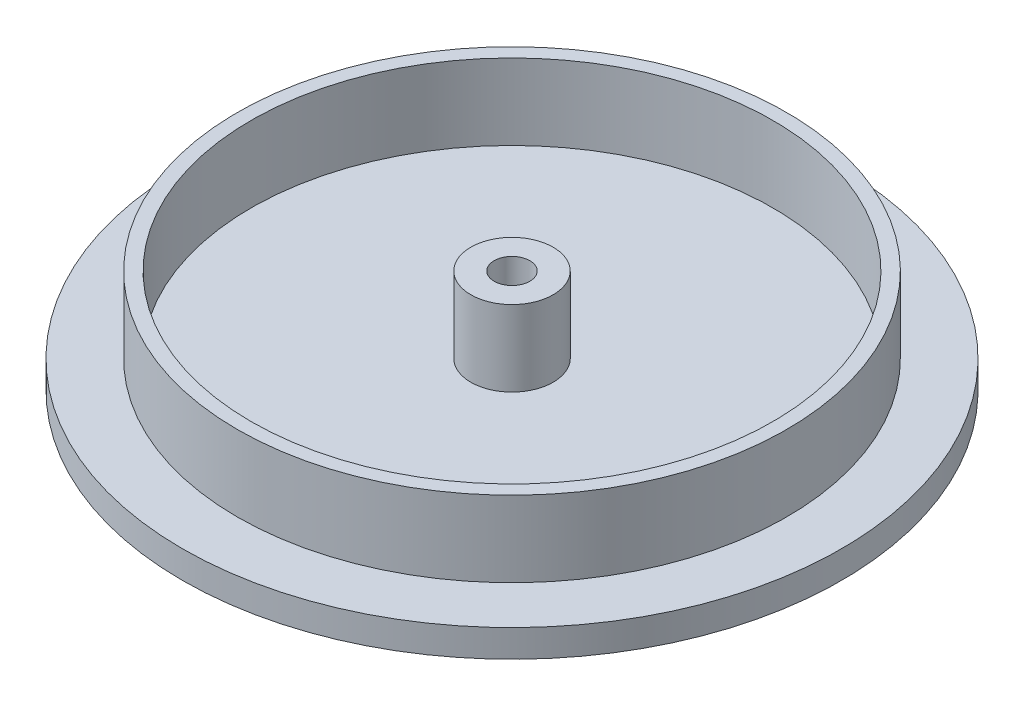
ISO-10303-21;
HEADER;
FILE_DESCRIPTION(('STEP AP214'),'2;1');
FILE_NAME('part.step','',(''),(''),'','','');
FILE_SCHEMA(('AUTOMOTIVE_DESIGN { 1 0 10303 214 1 1 1 1 }'));
ENDSEC;
DATA;
#1=APPLICATION_CONTEXT('core data for automotive mechanical design processes');
#2=APPLICATION_PROTOCOL_DEFINITION('international standard','automotive_design',2000,#1);
#3=PRODUCT_CONTEXT('',#1,'mechanical');
#4=PRODUCT('Part','Part','',(#3));
#5=PRODUCT_RELATED_PRODUCT_CATEGORY('part','',(#4));
#6=PRODUCT_DEFINITION_FORMATION('','',#4);
#7=PRODUCT_DEFINITION_CONTEXT('part definition',#1,'design');
#8=PRODUCT_DEFINITION('design','',#6,#7);
#9=PRODUCT_DEFINITION_SHAPE('','',#8);
#10=(LENGTH_UNIT() NAMED_UNIT(*) SI_UNIT(.MILLI.,.METRE.));
#11=(NAMED_UNIT(*) PLANE_ANGLE_UNIT() SI_UNIT($,.RADIAN.));
#12=(NAMED_UNIT(*) SI_UNIT($,.STERADIAN.) SOLID_ANGLE_UNIT());
#13=UNCERTAINTY_MEASURE_WITH_UNIT(LENGTH_MEASURE(1.E-05),#10,'distance_accuracy_value','');
#14=(GEOMETRIC_REPRESENTATION_CONTEXT(3) GLOBAL_UNCERTAINTY_ASSIGNED_CONTEXT((#13)) GLOBAL_UNIT_ASSIGNED_CONTEXT((#10,
#11,#12)) REPRESENTATION_CONTEXT('',''));
#15=CARTESIAN_POINT('',(0.,0.,0.));
#16=DIRECTION('',(0.,0.,1.));
#17=DIRECTION('',(1.,0.,0.));
#18=AXIS2_PLACEMENT_3D('',#15,#16,#17);
#19=CARTESIAN_POINT('',(0.,5.,0.));
#20=DIRECTION('',(0.,-1.,0.));
#21=DIRECTION('',(0.,0.,-1.));
#22=AXIS2_PLACEMENT_3D('',#19,#20,#21);
#23=CYLINDRICAL_SURFACE('',#22,60.);
#24=CARTESIAN_POINT('',(0.,5.,0.));
#25=DIRECTION('',(0.,1.,0.));
#26=DIRECTION('',(0.,0.,1.));
#27=AXIS2_PLACEMENT_3D('',#24,#25,#26);
#28=CIRCLE('',#27,60.);
#29=CARTESIAN_POINT('',(0.,5.,60.));
#30=VERTEX_POINT('',#29);
#31=EDGE_CURVE('E38',#30,#30,#28,.T.);
#32=ORIENTED_EDGE('',*,*,#31,.F.);
#33=EDGE_LOOP('',(#32));
#34=FACE_BOUND('',#33,.T.);
#35=CARTESIAN_POINT('',(0.,0.,0.));
#36=DIRECTION('',(0.,1.,0.));
#37=DIRECTION('',(0.,0.,1.));
#38=AXIS2_PLACEMENT_3D('',#35,#36,#37);
#39=CIRCLE('',#38,60.);
#40=CARTESIAN_POINT('',(0.,0.,60.));
#41=VERTEX_POINT('',#40);
#42=EDGE_CURVE('E34',#41,#41,#39,.T.);
#43=ORIENTED_EDGE('',*,*,#42,.T.);
#44=EDGE_LOOP('',(#43));
#45=FACE_BOUND('',#44,.T.);
#46=ADVANCED_FACE('F31',(#34,#45),#23,.T.);
#47=CARTESIAN_POINT('',(0.,5.,0.));
#48=DIRECTION('',(0.,1.,0.));
#49=DIRECTION('',(0.,0.,1.));
#50=AXIS2_PLACEMENT_3D('',#47,#48,#49);
#51=PLANE('',#50);
#52=CARTESIAN_POINT('',(0.,5.,0.));
#53=DIRECTION('',(0.,1.,0.));
#54=DIRECTION('',(0.,0.,1.));
#55=AXIS2_PLACEMENT_3D('',#52,#53,#54);
#56=CIRCLE('',#55,50.);
#57=CARTESIAN_POINT('',(0.,5.,50.));
#58=VERTEX_POINT('',#57);
#59=EDGE_CURVE('E10',#58,#58,#56,.T.);
#60=ORIENTED_EDGE('',*,*,#59,.F.);
#61=EDGE_LOOP('',(#60));
#62=FACE_BOUND('',#61,.T.);
#63=ORIENTED_EDGE('',*,*,#31,.T.);
#64=EDGE_LOOP('',(#63));
#65=FACE_BOUND('',#64,.T.);
#66=ADVANCED_FACE('F106',(#62,#65),#51,.T.);
#67=CARTESIAN_POINT('',(0.,0.,0.));
#68=DIRECTION('',(0.,1.,0.));
#69=DIRECTION('',(0.,0.,1.));
#70=AXIS2_PLACEMENT_3D('',#67,#68,#69);
#71=PLANE('',#70);
#72=CARTESIAN_POINT('',(0.,0.,0.));
#73=DIRECTION('',(0.,1.,0.));
#74=DIRECTION('',(0.,0.,1.));
#75=AXIS2_PLACEMENT_3D('',#72,#73,#74);
#76=CIRCLE('',#75,3.25);
#77=CARTESIAN_POINT('',(0.,0.,3.25));
#78=VERTEX_POINT('',#77);
#79=EDGE_CURVE('E57',#78,#78,#76,.T.);
#80=ORIENTED_EDGE('',*,*,#79,.T.);
#81=EDGE_LOOP('',(#80));
#82=FACE_BOUND('',#81,.T.);
#83=ORIENTED_EDGE('',*,*,#42,.F.);
#84=EDGE_LOOP('',(#83));
#85=FACE_BOUND('',#84,.T.);
#86=ADVANCED_FACE('F101',(#82,#85),#71,.F.);
#87=CARTESIAN_POINT('',(0.,18.8,0.));
#88=DIRECTION('',(0.,-1.,0.));
#89=DIRECTION('',(0.,0.,-1.));
#90=AXIS2_PLACEMENT_3D('',#87,#88,#89);
#91=CYLINDRICAL_SURFACE('',#90,50.);
#92=CARTESIAN_POINT('',(0.,18.8,0.));
#93=DIRECTION('',(0.,1.,0.));
#94=DIRECTION('',(0.,0.,1.));
#95=AXIS2_PLACEMENT_3D('',#92,#93,#94);
#96=CIRCLE('',#95,50.);
#97=CARTESIAN_POINT('',(0.,18.8,50.));
#98=VERTEX_POINT('',#97);
#99=EDGE_CURVE('E44',#98,#98,#96,.T.);
#100=ORIENTED_EDGE('',*,*,#99,.F.);
#101=EDGE_LOOP('',(#100));
#102=FACE_BOUND('',#101,.T.);
#103=ORIENTED_EDGE('',*,*,#59,.T.);
#104=EDGE_LOOP('',(#103));
#105=FACE_BOUND('',#104,.T.);
#106=ADVANCED_FACE('F96',(#102,#105),#91,.T.);
#107=CARTESIAN_POINT('',(0.,18.8,0.));
#108=DIRECTION('',(0.,1.,0.));
#109=DIRECTION('',(0.,0.,1.));
#110=AXIS2_PLACEMENT_3D('',#107,#108,#109);
#111=PLANE('',#110);
#112=CARTESIAN_POINT('',(0.,18.8,0.));
#113=DIRECTION('',(0.,1.,0.));
#114=DIRECTION('',(0.,0.,1.));
#115=AXIS2_PLACEMENT_3D('',#112,#113,#114);
#116=CIRCLE('',#115,47.5);
#117=CARTESIAN_POINT('',(0.,18.8,47.5));
#118=VERTEX_POINT('',#117);
#119=EDGE_CURVE('E48',#118,#118,#116,.T.);
#120=ORIENTED_EDGE('',*,*,#119,.F.);
#121=EDGE_LOOP('',(#120));
#122=FACE_BOUND('',#121,.T.);
#123=ORIENTED_EDGE('',*,*,#99,.T.);
#124=EDGE_LOOP('',(#123));
#125=FACE_BOUND('',#124,.T.);
#126=ADVANCED_FACE('F90',(#122,#125),#111,.T.);
#127=CARTESIAN_POINT('',(0.,5.,0.));
#128=DIRECTION('',(0.,1.,0.));
#129=DIRECTION('',(0.,0.,1.));
#130=AXIS2_PLACEMENT_3D('',#127,#128,#129);
#131=CYLINDRICAL_SURFACE('',#130,47.5);
#132=CARTESIAN_POINT('',(0.,5.,0.));
#133=DIRECTION('',(0.,1.,0.));
#134=DIRECTION('',(0.,0.,1.));
#135=AXIS2_PLACEMENT_3D('',#132,#133,#134);
#136=CIRCLE('',#135,47.5);
#137=CARTESIAN_POINT('',(0.,5.,47.5));
#138=VERTEX_POINT('',#137);
#139=EDGE_CURVE('E47',#138,#138,#136,.T.);
#140=ORIENTED_EDGE('',*,*,#139,.F.);
#141=EDGE_LOOP('',(#140));
#142=FACE_BOUND('',#141,.T.);
#143=ORIENTED_EDGE('',*,*,#119,.T.);
#144=EDGE_LOOP('',(#143));
#145=FACE_BOUND('',#144,.T.);
#146=ADVANCED_FACE('F84',(#142,#145),#131,.F.);
#147=CARTESIAN_POINT('',(0.,5.,0.));
#148=DIRECTION('',(0.,1.,0.));
#149=DIRECTION('',(0.,0.,1.));
#150=AXIS2_PLACEMENT_3D('',#147,#148,#149);
#151=PLANE('',#150);
#152=CARTESIAN_POINT('',(0.,5.,0.));
#153=DIRECTION('',(0.,1.,0.));
#154=DIRECTION('',(0.,0.,1.));
#155=AXIS2_PLACEMENT_3D('',#152,#153,#154);
#156=CIRCLE('',#155,7.5);
#157=CARTESIAN_POINT('',(0.,5.,7.5));
#158=VERTEX_POINT('',#157);
#159=EDGE_CURVE('E54',#158,#158,#156,.T.);
#160=ORIENTED_EDGE('',*,*,#159,.F.);
#161=EDGE_LOOP('',(#160));
#162=FACE_BOUND('',#161,.T.);
#163=ORIENTED_EDGE('',*,*,#139,.T.);
#164=EDGE_LOOP('',(#163));
#165=FACE_BOUND('',#164,.T.);
#166=ADVANCED_FACE('F78',(#162,#165),#151,.T.);
#167=CARTESIAN_POINT('',(0.,18.8,0.));
#168=DIRECTION('',(0.,-1.,0.));
#169=DIRECTION('',(0.,0.,-1.));
#170=AXIS2_PLACEMENT_3D('',#167,#168,#169);
#171=CYLINDRICAL_SURFACE('',#170,7.5);
#172=CARTESIAN_POINT('',(0.,18.8,0.));
#173=DIRECTION('',(0.,1.,0.));
#174=DIRECTION('',(0.,0.,1.));
#175=AXIS2_PLACEMENT_3D('',#172,#173,#174);
#176=CIRCLE('',#175,7.5);
#177=CARTESIAN_POINT('',(0.,18.8,7.5));
#178=VERTEX_POINT('',#177);
#179=EDGE_CURVE('E51',#178,#178,#176,.T.);
#180=ORIENTED_EDGE('',*,*,#179,.F.);
#181=EDGE_LOOP('',(#180));
#182=FACE_BOUND('',#181,.T.);
#183=ORIENTED_EDGE('',*,*,#159,.T.);
#184=EDGE_LOOP('',(#183));
#185=FACE_BOUND('',#184,.T.);
#186=ADVANCED_FACE('F72',(#182,#185),#171,.T.);
#187=CARTESIAN_POINT('',(0.,18.8,0.));
#188=DIRECTION('',(0.,1.,0.));
#189=DIRECTION('',(0.,0.,1.));
#190=AXIS2_PLACEMENT_3D('',#187,#188,#189);
#191=PLANE('',#190);
#192=CARTESIAN_POINT('',(0.,18.8,0.));
#193=DIRECTION('',(0.,1.,0.));
#194=DIRECTION('',(0.,0.,1.));
#195=AXIS2_PLACEMENT_3D('',#192,#193,#194);
#196=CIRCLE('',#195,3.25);
#197=CARTESIAN_POINT('',(0.,18.8,3.25));
#198=VERTEX_POINT('',#197);
#199=EDGE_CURVE('E62',#198,#198,#196,.T.);
#200=ORIENTED_EDGE('',*,*,#199,.F.);
#201=EDGE_LOOP('',(#200));
#202=FACE_BOUND('',#201,.T.);
#203=ORIENTED_EDGE('',*,*,#179,.T.);
#204=EDGE_LOOP('',(#203));
#205=FACE_BOUND('',#204,.T.);
#206=ADVANCED_FACE('F69',(#202,#205),#191,.T.);
#207=CARTESIAN_POINT('',(0.,-16.2,0.));
#208=DIRECTION('',(0.,1.,0.));
#209=DIRECTION('',(0.,0.,1.));
#210=AXIS2_PLACEMENT_3D('',#207,#208,#209);
#211=CYLINDRICAL_SURFACE('',#210,3.25);
#212=ORIENTED_EDGE('',*,*,#199,.T.);
#213=EDGE_LOOP('',(#212));
#214=FACE_BOUND('',#213,.T.);
#215=ORIENTED_EDGE('',*,*,#79,.F.);
#216=EDGE_LOOP('',(#215));
#217=FACE_BOUND('',#216,.T.);
#218=ADVANCED_FACE('F66',(#214,#217),#211,.F.);
#219=CLOSED_SHELL('',(#46,#66,#86,#106,#126,#146,#166,#186,#206,#218));
#220=MANIFOLD_SOLID_BREP('B2',#219);
#221=ADVANCED_BREP_SHAPE_REPRESENTATION('',(#18,#220),#14);
#222=SHAPE_DEFINITION_REPRESENTATION(#9,#221);
ENDSEC;
END-ISO-10303-21;
